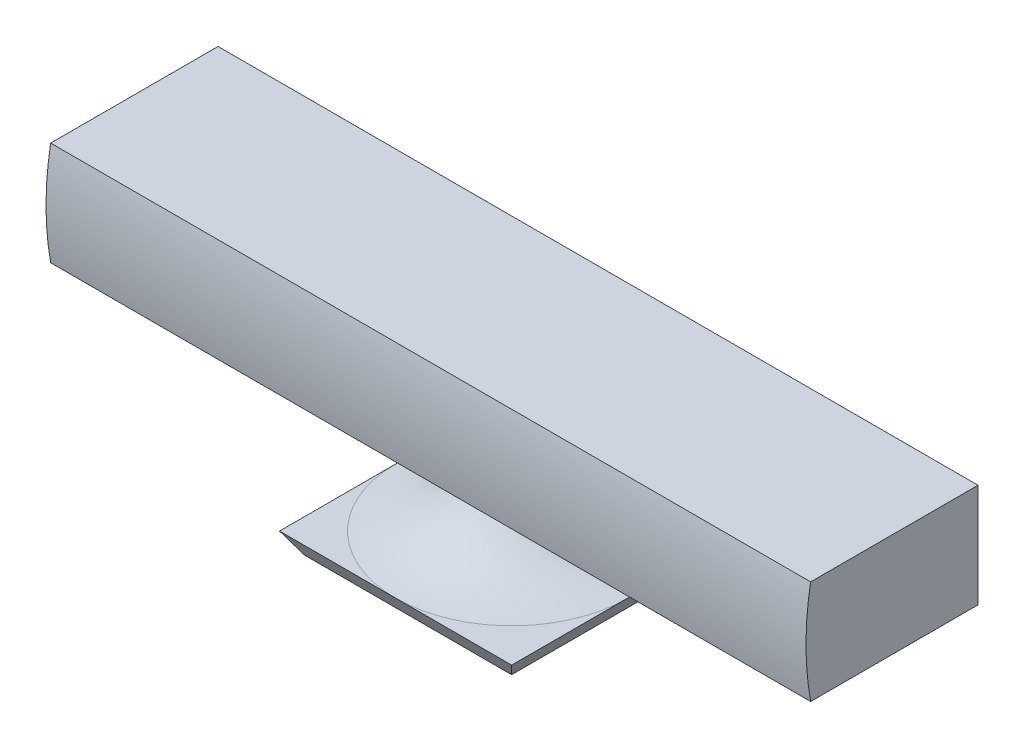
ISO-10303-21;
HEADER;
FILE_DESCRIPTION(('STEP AP214'),'2;1');
FILE_NAME('part.step','',(''),(''),'','','');
FILE_SCHEMA(('AUTOMOTIVE_DESIGN { 1 0 10303 214 1 1 1 1 }'));
ENDSEC;
DATA;
#1=APPLICATION_CONTEXT('core data for automotive mechanical design processes');
#2=APPLICATION_PROTOCOL_DEFINITION('international standard','automotive_design',2000,#1);
#3=PRODUCT_CONTEXT('',#1,'mechanical');
#4=PRODUCT('Part','Part','',(#3));
#5=PRODUCT_RELATED_PRODUCT_CATEGORY('part','',(#4));
#6=PRODUCT_DEFINITION_FORMATION('','',#4);
#7=PRODUCT_DEFINITION_CONTEXT('part definition',#1,'design');
#8=PRODUCT_DEFINITION('design','',#6,#7);
#9=PRODUCT_DEFINITION_SHAPE('','',#8);
#10=(LENGTH_UNIT() NAMED_UNIT(*) SI_UNIT(.MILLI.,.METRE.));
#11=(NAMED_UNIT(*) PLANE_ANGLE_UNIT() SI_UNIT($,.RADIAN.));
#12=(NAMED_UNIT(*) SI_UNIT($,.STERADIAN.) SOLID_ANGLE_UNIT());
#13=UNCERTAINTY_MEASURE_WITH_UNIT(LENGTH_MEASURE(1.E-05),#10,'distance_accuracy_value','');
#14=(GEOMETRIC_REPRESENTATION_CONTEXT(3) GLOBAL_UNCERTAINTY_ASSIGNED_CONTEXT((#13)) GLOBAL_UNIT_ASSIGNED_CONTEXT((#10,
#11,#12)) REPRESENTATION_CONTEXT('',''));
#15=CARTESIAN_POINT('',(0.,0.,0.));
#16=DIRECTION('',(0.,0.,1.));
#17=DIRECTION('',(1.,0.,0.));
#18=AXIS2_PLACEMENT_3D('',#15,#16,#17);
#19=CARTESIAN_POINT('',(139.7,-19.05,-31.75));
#20=DIRECTION('',(1.,0.,0.));
#21=DIRECTION('',(0.,0.,-1.));
#22=AXIS2_PLACEMENT_3D('',#19,#20,#21);
#23=PLANE('',#22);
#24=CARTESIAN_POINT('',(139.7,-19.05,29.7783955328807));
#25=CARTESIAN_POINT('',(139.7,-0.00370185474240388,33.2223003030911));
#26=CARTESIAN_POINT('',(139.7,19.05,29.7783955328807));
#27=B_SPLINE_CURVE_WITH_KNOTS('',2,(#24,#25,#26),.UNSPECIFIED.,.F.,.F.,(3,3),(0.,1.),.UNSPECIFIED.);
#28=CARTESIAN_POINT('',(139.7,-19.05,29.7783955328807));
#29=VERTEX_POINT('',#28);
#30=CARTESIAN_POINT('',(139.7,19.05,29.7783955328807));
#31=VERTEX_POINT('',#30);
#32=EDGE_CURVE('E46',#29,#31,#27,.T.);
#33=ORIENTED_EDGE('',*,*,#32,.F.);
#34=DIRECTION('',(0.,0.,1.));
#35=VECTOR('',#34,1.);
#36=CARTESIAN_POINT('',(139.7,-19.05,-31.75));
#37=LINE('',#36,#35);
#38=CARTESIAN_POINT('',(139.7,-19.05,-31.75));
#39=VERTEX_POINT('',#38);
#40=EDGE_CURVE('E131',#39,#29,#37,.T.);
#41=ORIENTED_EDGE('',*,*,#40,.F.);
#42=DIRECTION('',(0.,1.,0.));
#43=VECTOR('',#42,1.);
#44=CARTESIAN_POINT('',(139.7,-19.05,-31.75));
#45=LINE('',#44,#43);
#46=CARTESIAN_POINT('',(139.7,19.05,-31.75));
#47=VERTEX_POINT('',#46);
#48=EDGE_CURVE('E183',#39,#47,#45,.T.);
#49=ORIENTED_EDGE('',*,*,#48,.T.);
#50=DIRECTION('',(0.,0.,1.));
#51=VECTOR('',#50,1.);
#52=CARTESIAN_POINT('',(139.7,19.05,-31.75));
#53=LINE('',#52,#51);
#54=EDGE_CURVE('E129',#47,#31,#53,.T.);
#55=ORIENTED_EDGE('',*,*,#54,.T.);
#56=EDGE_LOOP('',(#33,#41,#49,#55));
#57=FACE_BOUND('',#56,.T.);
#58=ADVANCED_FACE('F32',(#57),#23,.T.);
#59=CARTESIAN_POINT('',(-139.7,-19.05,-31.75));
#60=DIRECTION('',(0.,-1.,0.));
#61=DIRECTION('',(0.,0.,-1.));
#62=AXIS2_PLACEMENT_3D('',#59,#60,#61);
#63=PLANE('',#62);
#64=DIRECTION('',(1.,0.,0.));
#65=VECTOR('',#64,1.);
#66=CARTESIAN_POINT('',(-139.7,-19.05,29.7783955328807));
#67=LINE('',#66,#65);
#68=CARTESIAN_POINT('',(-139.7,-19.05,29.7783955328807));
#69=VERTEX_POINT('',#68);
#70=EDGE_CURVE('E115',#69,#29,#67,.T.);
#71=ORIENTED_EDGE('',*,*,#70,.F.);
#72=DIRECTION('',(0.,0.,1.));
#73=VECTOR('',#72,1.);
#74=CARTESIAN_POINT('',(-139.7,-19.05,-31.75));
#75=LINE('',#74,#73);
#76=CARTESIAN_POINT('',(-139.7,-19.05,-31.75));
#77=VERTEX_POINT('',#76);
#78=EDGE_CURVE('E123',#77,#69,#75,.T.);
#79=ORIENTED_EDGE('',*,*,#78,.F.);
#80=DIRECTION('',(1.,0.,0.));
#81=VECTOR('',#80,1.);
#82=CARTESIAN_POINT('',(-139.7,-19.05,-31.75));
#83=LINE('',#82,#81);
#84=EDGE_CURVE('E133',#77,#39,#83,.T.);
#85=ORIENTED_EDGE('',*,*,#84,.T.);
#86=ORIENTED_EDGE('',*,*,#40,.T.);
#87=EDGE_LOOP('',(#71,#79,#85,#86));
#88=FACE_BOUND('',#87,.T.);
#89=CARTESIAN_POINT('',(0.,-19.05,0.));
#90=DIRECTION('',(0.,1.,0.));
#91=DIRECTION('',(0.,0.,1.));
#92=AXIS2_PLACEMENT_3D('',#89,#90,#91);
#93=CIRCLE('',#92,6.16755268103036);
#94=CARTESIAN_POINT('',(0.,-19.05,6.16755268103036));
#95=VERTEX_POINT('',#94);
#96=EDGE_CURVE('E174',#95,#95,#93,.T.);
#97=ORIENTED_EDGE('',*,*,#96,.T.);
#98=EDGE_LOOP('',(#97));
#99=FACE_BOUND('',#98,.T.);
#100=ADVANCED_FACE('F192',(#88,#99),#63,.T.);
#101=CARTESIAN_POINT('',(-139.7,-19.05,-31.75));
#102=DIRECTION('',(-1.,0.,0.));
#103=DIRECTION('',(0.,0.,1.));
#104=AXIS2_PLACEMENT_3D('',#101,#102,#103);
#105=PLANE('',#104);
#106=CARTESIAN_POINT('',(-139.7,-19.05,29.7783955328807));
#107=CARTESIAN_POINT('',(-139.7,-0.00370185474240388,33.2223003030911));
#108=CARTESIAN_POINT('',(-139.7,19.05,29.7783955328807));
#109=B_SPLINE_CURVE_WITH_KNOTS('',2,(#106,#107,#108),.UNSPECIFIED.,.F.,.F.,(3,3),(0.,1.),.UNSPECIFIED.);
#110=CARTESIAN_POINT('',(-139.7,19.05,29.7783955328807));
#111=VERTEX_POINT('',#110);
#112=EDGE_CURVE('E110',#69,#111,#109,.T.);
#113=ORIENTED_EDGE('',*,*,#112,.T.);
#114=DIRECTION('',(0.,0.,1.));
#115=VECTOR('',#114,1.);
#116=CARTESIAN_POINT('',(-139.7,19.05,-31.75));
#117=LINE('',#116,#115);
#118=CARTESIAN_POINT('',(-139.7,19.05,-31.75));
#119=VERTEX_POINT('',#118);
#120=EDGE_CURVE('E121',#119,#111,#117,.T.);
#121=ORIENTED_EDGE('',*,*,#120,.F.);
#122=DIRECTION('',(0.,-1.,0.));
#123=VECTOR('',#122,1.);
#124=CARTESIAN_POINT('',(-139.7,-19.05,-31.75));
#125=LINE('',#124,#123);
#126=EDGE_CURVE('E187',#119,#77,#125,.T.);
#127=ORIENTED_EDGE('',*,*,#126,.T.);
#128=ORIENTED_EDGE('',*,*,#78,.T.);
#129=EDGE_LOOP('',(#113,#121,#127,#128));
#130=FACE_BOUND('',#129,.T.);
#131=ADVANCED_FACE('F119',(#130),#105,.T.);
#132=CARTESIAN_POINT('',(-139.7,19.05,-31.75));
#133=DIRECTION('',(0.,1.,0.));
#134=DIRECTION('',(0.,0.,1.));
#135=AXIS2_PLACEMENT_3D('',#132,#133,#134);
#136=PLANE('',#135);
#137=DIRECTION('',(1.,0.,0.));
#138=VECTOR('',#137,1.);
#139=CARTESIAN_POINT('',(-139.7,19.05,29.7783955328807));
#140=LINE('',#139,#138);
#141=EDGE_CURVE('E107',#111,#31,#140,.T.);
#142=ORIENTED_EDGE('',*,*,#141,.T.);
#143=ORIENTED_EDGE('',*,*,#54,.F.);
#144=DIRECTION('',(-1.,0.,0.));
#145=VECTOR('',#144,1.);
#146=CARTESIAN_POINT('',(-139.7,19.05,-31.75));
#147=LINE('',#146,#145);
#148=EDGE_CURVE('E128',#47,#119,#147,.T.);
#149=ORIENTED_EDGE('',*,*,#148,.T.);
#150=ORIENTED_EDGE('',*,*,#120,.T.);
#151=EDGE_LOOP('',(#142,#143,#149,#150));
#152=FACE_BOUND('',#151,.T.);
#153=ADVANCED_FACE('F126',(#152),#136,.T.);
#154=CARTESIAN_POINT('',(139.7,19.05,-31.75));
#155=DIRECTION('',(0.,0.,-1.));
#156=DIRECTION('',(-1.,0.,0.));
#157=AXIS2_PLACEMENT_3D('',#154,#155,#156);
#158=PLANE('',#157);
#159=ORIENTED_EDGE('',*,*,#48,.F.);
#160=ORIENTED_EDGE('',*,*,#84,.F.);
#161=ORIENTED_EDGE('',*,*,#126,.F.);
#162=ORIENTED_EDGE('',*,*,#148,.F.);
#163=EDGE_LOOP('',(#159,#160,#161,#162));
#164=FACE_BOUND('',#163,.T.);
#165=ADVANCED_FACE('F198',(#164),#158,.T.);
#166=CARTESIAN_POINT('',(-42.672,-49.51771024429,0.));
#167=DIRECTION('',(0.,-1.,0.));
#168=DIRECTION('',(0.,0.,-1.));
#169=AXIS2_PLACEMENT_3D('',#166,#167,#168);
#170=PLANE('',#169);
#171=DIRECTION('',(1.,0.,0.));
#172=VECTOR('',#171,1.);
#173=CARTESIAN_POINT('',(-42.672,-49.51771024429,-42.672));
#174=LINE('',#173,#172);
#175=CARTESIAN_POINT('',(0.,-49.5177102442899,-42.672));
#176=VERTEX_POINT('',#175);
#177=CARTESIAN_POINT('',(42.672,-49.51771024429,-42.672));
#178=VERTEX_POINT('',#177);
#179=EDGE_CURVE('E137',#176,#178,#174,.T.);
#180=ORIENTED_EDGE('',*,*,#179,.F.);
#181=CARTESIAN_POINT('',(0.,-49.51771024429,0.));
#182=DIRECTION('',(0.,1.,0.));
#183=DIRECTION('',(0.,0.,1.));
#184=AXIS2_PLACEMENT_3D('',#181,#182,#183);
#185=CIRCLE('',#184,42.672);
#186=CARTESIAN_POINT('',(42.672,-49.51771024429,0.));
#187=VERTEX_POINT('',#186);
#188=EDGE_CURVE('E157',#187,#176,#185,.T.);
#189=ORIENTED_EDGE('',*,*,#188,.F.);
#190=DIRECTION('',(0.,0.,1.));
#191=VECTOR('',#190,1.);
#192=CARTESIAN_POINT('',(42.672,-49.51771024429,-42.672));
#193=LINE('',#192,#191);
#194=EDGE_CURVE('E159',#178,#187,#193,.T.);
#195=ORIENTED_EDGE('',*,*,#194,.F.);
#196=EDGE_LOOP('',(#180,#189,#195));
#197=FACE_BOUND('',#196,.T.);
#198=ADVANCED_FACE('F155',(#197),#170,.F.);
#199=CARTESIAN_POINT('',(0.,-49.51771024429,42.672));
#200=VERTEX_POINT('',#199);
#201=EDGE_CURVE('E171',#200,#187,#185,.T.);
#202=ORIENTED_EDGE('',*,*,#201,.F.);
#203=DIRECTION('',(-1.,0.,0.));
#204=VECTOR('',#203,1.);
#205=CARTESIAN_POINT('',(-42.672,-49.51771024429,42.672));
#206=LINE('',#205,#204);
#207=CARTESIAN_POINT('',(42.672,-49.51771024429,42.672));
#208=VERTEX_POINT('',#207);
#209=EDGE_CURVE('E180',#208,#200,#206,.T.);
#210=ORIENTED_EDGE('',*,*,#209,.F.);
#211=EDGE_CURVE('E181',#187,#208,#193,.T.);
#212=ORIENTED_EDGE('',*,*,#211,.F.);
#213=EDGE_LOOP('',(#202,#210,#212));
#214=FACE_BOUND('',#213,.T.);
#215=ADVANCED_FACE('F205',(#214),#170,.F.);
#216=CARTESIAN_POINT('',(-42.672,-49.51771024429,0.));
#217=VERTEX_POINT('',#216);
#218=EDGE_CURVE('E167',#217,#200,#185,.T.);
#219=ORIENTED_EDGE('',*,*,#218,.F.);
#220=DIRECTION('',(0.,0.,-1.));
#221=VECTOR('',#220,1.);
#222=CARTESIAN_POINT('',(-42.672,-49.51771024429,-42.672));
#223=LINE('',#222,#221);
#224=CARTESIAN_POINT('',(-42.672,-49.51771024429,42.672));
#225=VERTEX_POINT('',#224);
#226=EDGE_CURVE('E177',#225,#217,#223,.T.);
#227=ORIENTED_EDGE('',*,*,#226,.F.);
#228=EDGE_CURVE('E178',#200,#225,#206,.T.);
#229=ORIENTED_EDGE('',*,*,#228,.F.);
#230=EDGE_LOOP('',(#219,#227,#229));
#231=FACE_BOUND('',#230,.T.);
#232=ADVANCED_FACE('F282',(#231),#170,.F.);
#233=EDGE_CURVE('E161',#176,#217,#185,.T.);
#234=ORIENTED_EDGE('',*,*,#233,.F.);
#235=CARTESIAN_POINT('',(-42.6720000000001,-49.5177102442899,-42.672));
#236=VERTEX_POINT('',#235);
#237=EDGE_CURVE('E138',#236,#176,#174,.T.);
#238=ORIENTED_EDGE('',*,*,#237,.F.);
#239=EDGE_CURVE('E163',#217,#236,#223,.T.);
#240=ORIENTED_EDGE('',*,*,#239,.F.);
#241=EDGE_LOOP('',(#234,#238,#240));
#242=FACE_BOUND('',#241,.T.);
#243=ADVANCED_FACE('F162',(#242),#170,.F.);
#244=CARTESIAN_POINT('',(-42.672,-49.51771024429,0.));
#245=CARTESIAN_POINT('',(-14.4065843667005,-46.1231283399447,0.));
#246=CARTESIAN_POINT('',(-6.16755268103034,-19.05,0.));
#247=B_SPLINE_CURVE_WITH_KNOTS('',2,(#244,#245,#246),.UNSPECIFIED.,.F.,.F.,(3,3),(0.,1.),.UNSPECIFIED.);
#248=CARTESIAN_POINT('',(0.,-19.05,0.));
#249=DIRECTION('',(0.,1.,0.));
#250=AXIS1_PLACEMENT('',#248,#249);
#251=SURFACE_OF_REVOLUTION('',#247,#250);
#252=ORIENTED_EDGE('',*,*,#96,.F.);
#253=EDGE_LOOP('',(#252));
#254=FACE_BOUND('',#253,.T.);
#255=ORIENTED_EDGE('',*,*,#201,.T.);
#256=ORIENTED_EDGE('',*,*,#188,.T.);
#257=ORIENTED_EDGE('',*,*,#233,.T.);
#258=ORIENTED_EDGE('',*,*,#218,.T.);
#259=EDGE_LOOP('',(#255,#256,#257,#258));
#260=FACE_BOUND('',#259,.T.);
#261=ADVANCED_FACE('F169',(#254,#260),#251,.T.);
#262=CARTESIAN_POINT('',(42.672,-57.15,42.672));
#263=DIRECTION('',(0.,1.,0.));
#264=DIRECTION('',(0.,0.,1.));
#265=AXIS2_PLACEMENT_3D('',#262,#263,#264);
#266=PLANE('',#265);
#267=DIRECTION('',(0.,0.,1.));
#268=VECTOR('',#267,1.);
#269=CARTESIAN_POINT('',(-38.1,-57.15,-42.672));
#270=LINE('',#269,#268);
#271=CARTESIAN_POINT('',(-38.1000000000001,-57.1499999999998,-38.1));
#272=VERTEX_POINT('',#271);
#273=CARTESIAN_POINT('',(-38.1,-57.15,38.1));
#274=VERTEX_POINT('',#273);
#275=EDGE_CURVE('E340',#272,#274,#270,.T.);
#276=ORIENTED_EDGE('',*,*,#275,.F.);
#277=DIRECTION('',(1.,0.,0.));
#278=VECTOR('',#277,1.);
#279=CARTESIAN_POINT('',(-139.7,-57.1499999999998,-38.1));
#280=LINE('',#279,#278);
#281=CARTESIAN_POINT('',(38.1000000000001,-57.1499999999998,-38.1));
#282=VERTEX_POINT('',#281);
#283=EDGE_CURVE('E352',#272,#282,#280,.T.);
#284=ORIENTED_EDGE('',*,*,#283,.T.);
#285=DIRECTION('',(0.,0.,1.));
#286=VECTOR('',#285,1.);
#287=CARTESIAN_POINT('',(38.1,-57.15,-42.672));
#288=LINE('',#287,#286);
#289=CARTESIAN_POINT('',(38.1,-57.15,38.1));
#290=VERTEX_POINT('',#289);
#291=EDGE_CURVE('E54',#282,#290,#288,.T.);
#292=ORIENTED_EDGE('',*,*,#291,.T.);
#293=DIRECTION('',(1.,0.,0.));
#294=VECTOR('',#293,1.);
#295=CARTESIAN_POINT('',(-139.7,-57.15,38.1));
#296=LINE('',#295,#294);
#297=EDGE_CURVE('E349',#274,#290,#296,.T.);
#298=ORIENTED_EDGE('',*,*,#297,.F.);
#299=EDGE_LOOP('',(#276,#284,#292,#298));
#300=FACE_BOUND('',#299,.T.);
#301=ADVANCED_FACE('F262',(#300),#266,.F.);
#302=CARTESIAN_POINT('',(-38.1,-57.15,-42.672));
#303=DIRECTION('',(0.857858360842385,0.513886206015317,0.));
#304=DIRECTION('',(-0.513886206015317,0.857858360842385,0.));
#305=AXIS2_PLACEMENT_3D('',#302,#303,#304);
#306=PLANE('',#305);
#307=ORIENTED_EDGE('',*,*,#239,.T.);
#308=DIRECTION('',(0.457066978779872,-0.763006915970021,0.457066978779869));
#309=VECTOR('',#308,1.);
#310=CARTESIAN_POINT('',(-39.0551375399719,-55.5555366444398,-39.0551375399718));
#311=LINE('',#310,#309);
#312=EDGE_CURVE('E147',#236,#272,#311,.T.);
#313=ORIENTED_EDGE('',*,*,#312,.T.);
#314=ORIENTED_EDGE('',*,*,#275,.T.);
#315=DIRECTION('',(-0.457066978779871,0.76300691597002,0.457066978779871));
#316=VECTOR('',#315,1.);
#317=CARTESIAN_POINT('',(-21.225903460497,-85.3188526148972,21.225903460497));
#318=LINE('',#317,#316);
#319=EDGE_CURVE('E346',#274,#225,#318,.T.);
#320=ORIENTED_EDGE('',*,*,#319,.T.);
#321=ORIENTED_EDGE('',*,*,#226,.T.);
#322=EDGE_LOOP('',(#307,#313,#314,#320,#321));
#323=FACE_BOUND('',#322,.T.);
#324=ADVANCED_FACE('F255',(#323),#306,.F.);
#325=CARTESIAN_POINT('',(38.1,-57.15,-42.672));
#326=DIRECTION('',(-0.857858360842384,0.513886206015318,0.));
#327=DIRECTION('',(-0.513886206015318,-0.857858360842384,0.));
#328=AXIS2_PLACEMENT_3D('',#325,#326,#327);
#329=PLANE('',#328);
#330=ORIENTED_EDGE('',*,*,#291,.F.);
#331=DIRECTION('',(0.457066978779873,0.763006915970021,-0.457066978779868));
#332=VECTOR('',#331,1.);
#333=CARTESIAN_POINT('',(39.0551375399719,-55.5555366444397,-39.0551375399718));
#334=LINE('',#333,#332);
#335=EDGE_CURVE('E11',#282,#178,#334,.T.);
#336=ORIENTED_EDGE('',*,*,#335,.T.);
#337=ORIENTED_EDGE('',*,*,#194,.T.);
#338=ORIENTED_EDGE('',*,*,#211,.T.);
#339=DIRECTION('',(-0.457066978779872,-0.76300691597002,-0.457066978779871));
#340=VECTOR('',#339,1.);
#341=CARTESIAN_POINT('',(21.225903460497,-85.3188526148972,21.225903460497));
#342=LINE('',#341,#340);
#343=EDGE_CURVE('E39',#208,#290,#342,.T.);
#344=ORIENTED_EDGE('',*,*,#343,.T.);
#345=EDGE_LOOP('',(#330,#336,#337,#338,#344));
#346=FACE_BOUND('',#345,.T.);
#347=ADVANCED_FACE('F247',(#346),#329,.F.);
#348=CARTESIAN_POINT('',(-139.7,-57.15,38.1));
#349=DIRECTION('',(0.,0.513886206015317,-0.857858360842385));
#350=DIRECTION('',(0.,0.857858360842385,0.513886206015317));
#351=AXIS2_PLACEMENT_3D('',#348,#349,#350);
#352=PLANE('',#351);
#353=ORIENTED_EDGE('',*,*,#297,.T.);
#354=ORIENTED_EDGE('',*,*,#343,.F.);
#355=ORIENTED_EDGE('',*,*,#209,.T.);
#356=ORIENTED_EDGE('',*,*,#228,.T.);
#357=ORIENTED_EDGE('',*,*,#319,.F.);
#358=EDGE_LOOP('',(#353,#354,#355,#356,#357));
#359=FACE_BOUND('',#358,.T.);
#360=ADVANCED_FACE('F241',(#359),#352,.F.);
#361=CARTESIAN_POINT('',(-139.7,-57.1499999999998,-38.1));
#362=DIRECTION('',(0.,0.513886206015314,0.857858360842386));
#363=DIRECTION('',(0.,-0.857858360842386,0.513886206015314));
#364=AXIS2_PLACEMENT_3D('',#361,#362,#363);
#365=PLANE('',#364);
#366=ORIENTED_EDGE('',*,*,#237,.T.);
#367=ORIENTED_EDGE('',*,*,#179,.T.);
#368=ORIENTED_EDGE('',*,*,#335,.F.);
#369=ORIENTED_EDGE('',*,*,#283,.F.);
#370=ORIENTED_EDGE('',*,*,#312,.F.);
#371=EDGE_LOOP('',(#366,#367,#368,#369,#370));
#372=FACE_BOUND('',#371,.T.);
#373=ADVANCED_FACE('F145',(#372),#365,.F.);
#374=DIRECTION('',(1.,0.,0.));
#375=VECTOR('',#374,1.);
#376=SURFACE_OF_LINEAR_EXTRUSION('',#109,#375);
#377=ORIENTED_EDGE('',*,*,#32,.T.);
#378=ORIENTED_EDGE('',*,*,#141,.F.);
#379=ORIENTED_EDGE('',*,*,#112,.F.);
#380=ORIENTED_EDGE('',*,*,#70,.T.);
#381=EDGE_LOOP('',(#377,#378,#379,#380));
#382=FACE_BOUND('',#381,.T.);
#383=ADVANCED_FACE('F109',(#382),#376,.F.);
#384=CLOSED_SHELL('',(#58,#100,#131,#153,#165,#198,#215,#232,#243,#261,#301,#324,#347,#360,#373,#383));
#385=MANIFOLD_SOLID_BREP('B2',#384);
#386=ADVANCED_BREP_SHAPE_REPRESENTATION('',(#18,#385),#14);
#387=SHAPE_DEFINITION_REPRESENTATION(#9,#386);
ENDSEC;
END-ISO-10303-21;
